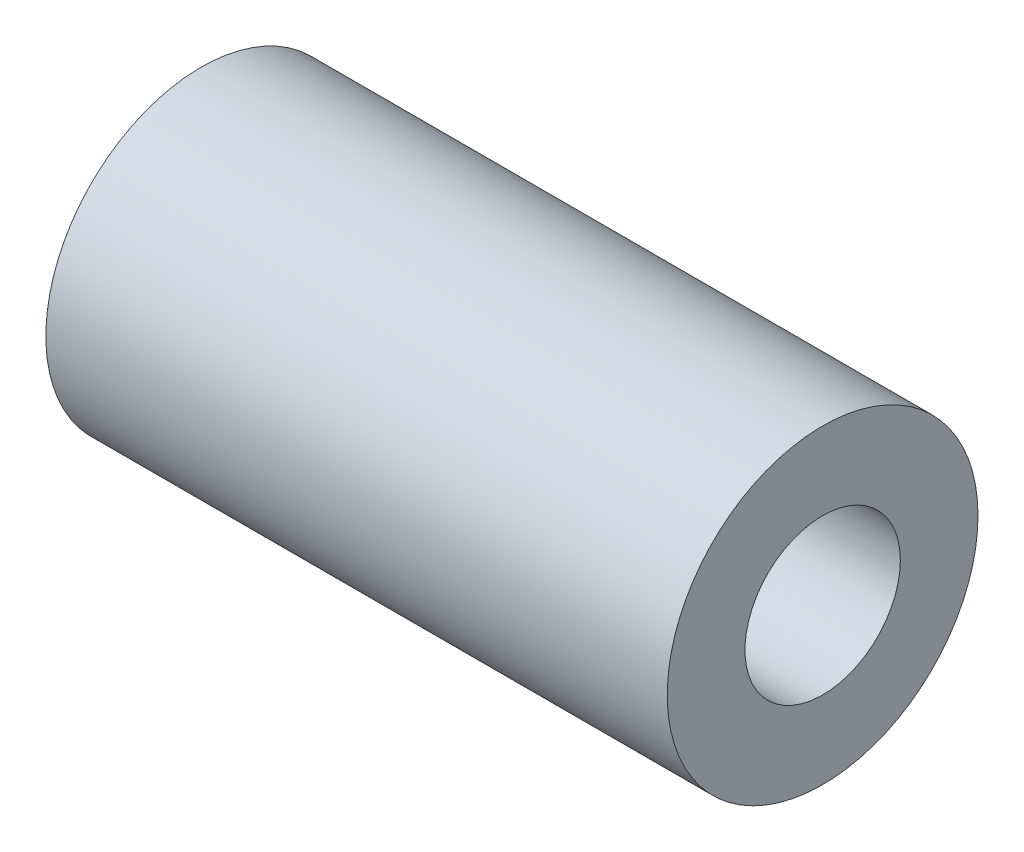
ISO-10303-21;
HEADER;
FILE_DESCRIPTION(('STEP AP214'),'2;1');
FILE_NAME('part.step','',(''),(''),'','','');
FILE_SCHEMA(('AUTOMOTIVE_DESIGN { 1 0 10303 214 1 1 1 1 }'));
ENDSEC;
DATA;
#1=APPLICATION_CONTEXT('core data for automotive mechanical design processes');
#2=APPLICATION_PROTOCOL_DEFINITION('international standard','automotive_design',2000,#1);
#3=PRODUCT_CONTEXT('',#1,'mechanical');
#4=PRODUCT('Part','Part','',(#3));
#5=PRODUCT_RELATED_PRODUCT_CATEGORY('part','',(#4));
#6=PRODUCT_DEFINITION_FORMATION('','',#4);
#7=PRODUCT_DEFINITION_CONTEXT('part definition',#1,'design');
#8=PRODUCT_DEFINITION('design','',#6,#7);
#9=PRODUCT_DEFINITION_SHAPE('','',#8);
#10=(LENGTH_UNIT() NAMED_UNIT(*) SI_UNIT(.MILLI.,.METRE.));
#11=(NAMED_UNIT(*) PLANE_ANGLE_UNIT() SI_UNIT($,.RADIAN.));
#12=(NAMED_UNIT(*) SI_UNIT($,.STERADIAN.) SOLID_ANGLE_UNIT());
#13=UNCERTAINTY_MEASURE_WITH_UNIT(LENGTH_MEASURE(1.E-05),#10,'distance_accuracy_value','');
#14=(GEOMETRIC_REPRESENTATION_CONTEXT(3) GLOBAL_UNCERTAINTY_ASSIGNED_CONTEXT((#13)) GLOBAL_UNIT_ASSIGNED_CONTEXT((#10,
#11,#12)) REPRESENTATION_CONTEXT('',''));
#15=CARTESIAN_POINT('',(0.,0.,0.));
#16=DIRECTION('',(0.,0.,1.));
#17=DIRECTION('',(1.,0.,0.));
#18=AXIS2_PLACEMENT_3D('',#15,#16,#17);
#19=CARTESIAN_POINT('',(-140.456117376093,50.,0.));
#20=DIRECTION('',(-1.,0.,0.));
#21=DIRECTION('',(0.,0.,1.));
#22=AXIS2_PLACEMENT_3D('',#19,#20,#21);
#23=PLANE('',#22);
#24=CARTESIAN_POINT('',(-140.456117376093,0.,0.));
#25=DIRECTION('',(1.,0.,0.));
#26=DIRECTION('',(0.,0.,-1.));
#27=AXIS2_PLACEMENT_3D('',#24,#25,#26);
#28=CIRCLE('',#27,25.);
#29=CARTESIAN_POINT('',(-140.456117376093,0.,-25.));
#30=VERTEX_POINT('',#29);
#31=EDGE_CURVE('E10',#30,#30,#28,.T.);
#32=ORIENTED_EDGE('',*,*,#31,.T.);
#33=EDGE_LOOP('',(#32));
#34=FACE_BOUND('',#33,.T.);
#35=CARTESIAN_POINT('',(-140.456117376093,0.,0.));
#36=DIRECTION('',(1.,0.,0.));
#37=DIRECTION('',(0.,0.,-1.));
#38=AXIS2_PLACEMENT_3D('',#35,#36,#37);
#39=CIRCLE('',#38,50.);
#40=CARTESIAN_POINT('',(-140.456117376093,0.,-50.));
#41=VERTEX_POINT('',#40);
#42=EDGE_CURVE('E66',#41,#41,#39,.T.);
#43=ORIENTED_EDGE('',*,*,#42,.F.);
#44=EDGE_LOOP('',(#43));
#45=FACE_BOUND('',#44,.T.);
#46=ADVANCED_FACE('F45',(#34,#45),#23,.T.);
#47=CARTESIAN_POINT('',(0.,0.,0.));
#48=DIRECTION('',(1.,0.,0.));
#49=DIRECTION('',(0.,0.,-1.));
#50=AXIS2_PLACEMENT_3D('',#47,#48,#49);
#51=CYLINDRICAL_SURFACE('',#50,25.);
#52=CARTESIAN_POINT('',(59.5438826239067,0.,0.));
#53=DIRECTION('',(1.,0.,0.));
#54=DIRECTION('',(0.,0.,-1.));
#55=AXIS2_PLACEMENT_3D('',#52,#53,#54);
#56=CIRCLE('',#55,25.);
#57=CARTESIAN_POINT('',(59.5438826239067,0.,-25.));
#58=VERTEX_POINT('',#57);
#59=EDGE_CURVE('E52',#58,#58,#56,.T.);
#60=ORIENTED_EDGE('',*,*,#59,.T.);
#61=EDGE_LOOP('',(#60));
#62=FACE_BOUND('',#61,.T.);
#63=ORIENTED_EDGE('',*,*,#31,.F.);
#64=EDGE_LOOP('',(#63));
#65=FACE_BOUND('',#64,.T.);
#66=ADVANCED_FACE('F79',(#62,#65),#51,.F.);
#67=CARTESIAN_POINT('',(59.5438826239067,50.,0.));
#68=DIRECTION('',(1.,0.,0.));
#69=DIRECTION('',(0.,0.,-1.));
#70=AXIS2_PLACEMENT_3D('',#67,#68,#69);
#71=PLANE('',#70);
#72=CARTESIAN_POINT('',(59.5438826239067,0.,0.));
#73=DIRECTION('',(1.,0.,0.));
#74=DIRECTION('',(0.,0.,-1.));
#75=AXIS2_PLACEMENT_3D('',#72,#73,#74);
#76=CIRCLE('',#75,50.);
#77=CARTESIAN_POINT('',(59.5438826239067,0.,-50.));
#78=VERTEX_POINT('',#77);
#79=EDGE_CURVE('E59',#78,#78,#76,.T.);
#80=ORIENTED_EDGE('',*,*,#79,.T.);
#81=EDGE_LOOP('',(#80));
#82=FACE_BOUND('',#81,.T.);
#83=ORIENTED_EDGE('',*,*,#59,.F.);
#84=EDGE_LOOP('',(#83));
#85=FACE_BOUND('',#84,.T.);
#86=ADVANCED_FACE('F83',(#82,#85),#71,.T.);
#87=CARTESIAN_POINT('',(0.,0.,0.));
#88=DIRECTION('',(1.,0.,0.));
#89=DIRECTION('',(0.,0.,-1.));
#90=AXIS2_PLACEMENT_3D('',#87,#88,#89);
#91=CYLINDRICAL_SURFACE('',#90,50.);
#92=ORIENTED_EDGE('',*,*,#42,.T.);
#93=EDGE_LOOP('',(#92));
#94=FACE_BOUND('',#93,.T.);
#95=ORIENTED_EDGE('',*,*,#79,.F.);
#96=EDGE_LOOP('',(#95));
#97=FACE_BOUND('',#96,.T.);
#98=ADVANCED_FACE('F75',(#94,#97),#91,.T.);
#99=CLOSED_SHELL('',(#46,#66,#86,#98));
#100=MANIFOLD_SOLID_BREP('B2',#99);
#101=ADVANCED_BREP_SHAPE_REPRESENTATION('',(#18,#100),#14);
#102=SHAPE_DEFINITION_REPRESENTATION(#9,#101);
ENDSEC;
END-ISO-10303-21;
